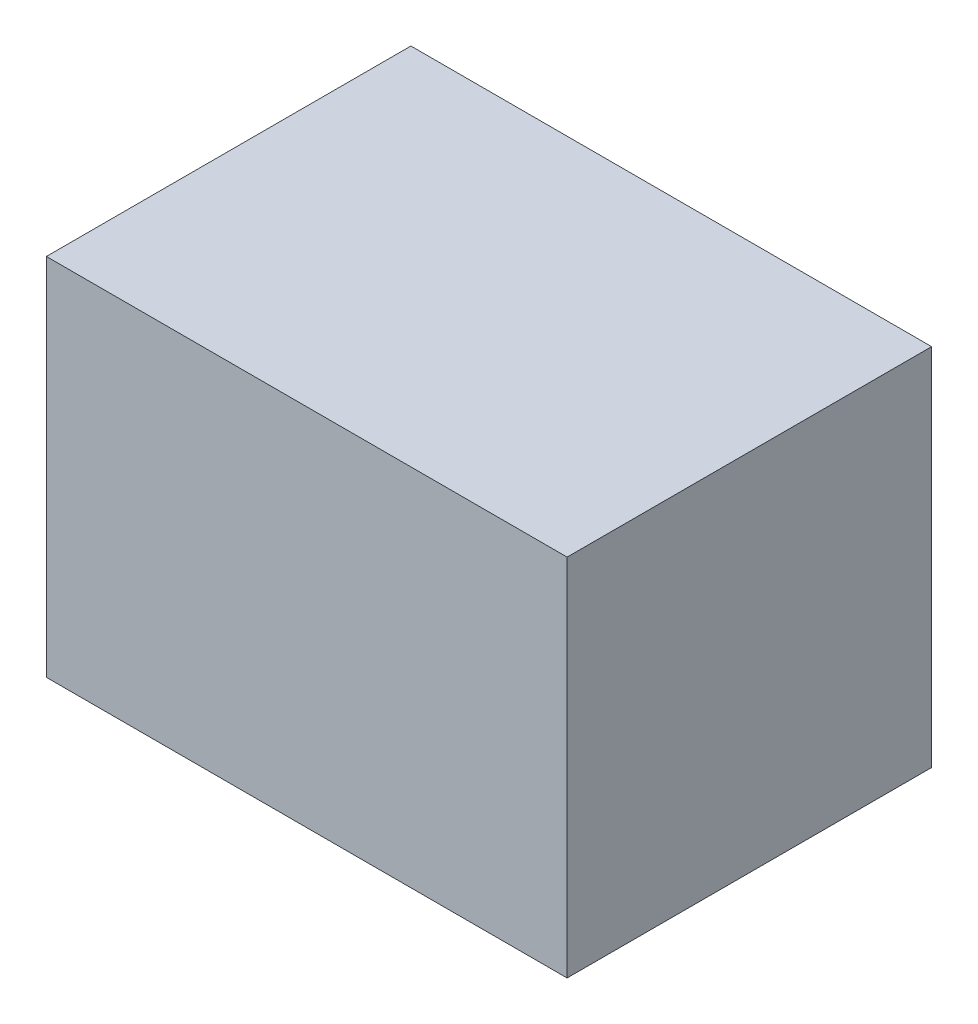
ISO-10303-21;
HEADER;
FILE_DESCRIPTION(('STEP AP214'),'2;1');
FILE_NAME('part.step','',(''),(''),'','','');
FILE_SCHEMA(('AUTOMOTIVE_DESIGN { 1 0 10303 214 1 1 1 1 }'));
ENDSEC;
DATA;
#1=APPLICATION_CONTEXT('core data for automotive mechanical design processes');
#2=APPLICATION_PROTOCOL_DEFINITION('international standard','automotive_design',2000,#1);
#3=PRODUCT_CONTEXT('',#1,'mechanical');
#4=PRODUCT('Part','Part','',(#3));
#5=PRODUCT_RELATED_PRODUCT_CATEGORY('part','',(#4));
#6=PRODUCT_DEFINITION_FORMATION('','',#4);
#7=PRODUCT_DEFINITION_CONTEXT('part definition',#1,'design');
#8=PRODUCT_DEFINITION('design','',#6,#7);
#9=PRODUCT_DEFINITION_SHAPE('','',#8);
#10=(LENGTH_UNIT() NAMED_UNIT(*) SI_UNIT(.MILLI.,.METRE.));
#11=(NAMED_UNIT(*) PLANE_ANGLE_UNIT() SI_UNIT($,.RADIAN.));
#12=(NAMED_UNIT(*) SI_UNIT($,.STERADIAN.) SOLID_ANGLE_UNIT());
#13=UNCERTAINTY_MEASURE_WITH_UNIT(LENGTH_MEASURE(1.E-05),#10,'distance_accuracy_value','');
#14=(GEOMETRIC_REPRESENTATION_CONTEXT(3) GLOBAL_UNCERTAINTY_ASSIGNED_CONTEXT((#13)) GLOBAL_UNIT_ASSIGNED_CONTEXT((#10,
#11,#12)) REPRESENTATION_CONTEXT('',''));
#15=CARTESIAN_POINT('',(0.,0.,0.));
#16=DIRECTION('',(0.,0.,1.));
#17=DIRECTION('',(1.,0.,0.));
#18=AXIS2_PLACEMENT_3D('',#15,#16,#17);
#19=CARTESIAN_POINT('',(-25.4,0.,0.));
#20=DIRECTION('',(0.,-1.,0.));
#21=DIRECTION('',(0.,0.,-1.));
#22=AXIS2_PLACEMENT_3D('',#19,#20,#21);
#23=PLANE('',#22);
#24=DIRECTION('',(1.,0.,0.));
#25=VECTOR('',#24,1.);
#26=CARTESIAN_POINT('',(-25.4,0.,-1.1));
#27=LINE('',#26,#25);
#28=CARTESIAN_POINT('',(-10.41,0.,-1.1));
#29=VERTEX_POINT('',#28);
#30=CARTESIAN_POINT('',(-9.91,0.,-1.1));
#31=VERTEX_POINT('',#30);
#32=EDGE_CURVE('E91',#29,#31,#27,.T.);
#33=ORIENTED_EDGE('',*,*,#32,.F.);
#34=DIRECTION('',(0.,0.,1.));
#35=VECTOR('',#34,1.);
#36=CARTESIAN_POINT('',(-10.41,0.,0.));
#37=LINE('',#36,#35);
#38=CARTESIAN_POINT('',(-10.41,0.,-0.75));
#39=VERTEX_POINT('',#38);
#40=EDGE_CURVE('E28',#29,#39,#37,.T.);
#41=ORIENTED_EDGE('',*,*,#40,.T.);
#42=DIRECTION('',(1.,0.,0.));
#43=VECTOR('',#42,1.);
#44=CARTESIAN_POINT('',(-25.4,0.,-0.75));
#45=LINE('',#44,#43);
#46=CARTESIAN_POINT('',(-9.91,0.,-0.75));
#47=VERTEX_POINT('',#46);
#48=EDGE_CURVE('E79',#39,#47,#45,.T.);
#49=ORIENTED_EDGE('',*,*,#48,.T.);
#50=DIRECTION('',(0.,0.,1.));
#51=VECTOR('',#50,1.);
#52=CARTESIAN_POINT('',(-9.91,0.,0.));
#53=LINE('',#52,#51);
#54=EDGE_CURVE('E103',#31,#47,#53,.T.);
#55=ORIENTED_EDGE('',*,*,#54,.F.);
#56=EDGE_LOOP('',(#33,#41,#49,#55));
#57=FACE_BOUND('',#56,.T.);
#58=ADVANCED_FACE('F17',(#57),#23,.F.);
#59=CARTESIAN_POINT('',(-25.4,-0.35,0.));
#60=DIRECTION('',(0.,-1.,0.));
#61=DIRECTION('',(0.,0.,-1.));
#62=AXIS2_PLACEMENT_3D('',#59,#60,#61);
#63=PLANE('',#62);
#64=DIRECTION('',(1.,0.,0.));
#65=VECTOR('',#64,1.);
#66=CARTESIAN_POINT('',(-25.4,-0.35,-1.1));
#67=LINE('',#66,#65);
#68=CARTESIAN_POINT('',(-10.41,-0.35,-1.1));
#69=VERTEX_POINT('',#68);
#70=CARTESIAN_POINT('',(-9.91,-0.35,-1.1));
#71=VERTEX_POINT('',#70);
#72=EDGE_CURVE('E82',#69,#71,#67,.T.);
#73=ORIENTED_EDGE('',*,*,#72,.T.);
#74=DIRECTION('',(0.,0.,1.));
#75=VECTOR('',#74,1.);
#76=CARTESIAN_POINT('',(-9.91,-0.35,0.));
#77=LINE('',#76,#75);
#78=CARTESIAN_POINT('',(-9.91,-0.35,-0.75));
#79=VERTEX_POINT('',#78);
#80=EDGE_CURVE('E69',#71,#79,#77,.T.);
#81=ORIENTED_EDGE('',*,*,#80,.T.);
#82=DIRECTION('',(1.,0.,0.));
#83=VECTOR('',#82,1.);
#84=CARTESIAN_POINT('',(-25.4,-0.35,-0.75));
#85=LINE('',#84,#83);
#86=CARTESIAN_POINT('',(-10.41,-0.35,-0.75));
#87=VERTEX_POINT('',#86);
#88=EDGE_CURVE('E107',#87,#79,#85,.T.);
#89=ORIENTED_EDGE('',*,*,#88,.F.);
#90=DIRECTION('',(0.,0.,1.));
#91=VECTOR('',#90,1.);
#92=CARTESIAN_POINT('',(-10.41,-0.35,0.));
#93=LINE('',#92,#91);
#94=EDGE_CURVE('E11',#69,#87,#93,.T.);
#95=ORIENTED_EDGE('',*,*,#94,.F.);
#96=EDGE_LOOP('',(#73,#81,#89,#95));
#97=FACE_BOUND('',#96,.T.);
#98=ADVANCED_FACE('F83',(#97),#63,.T.);
#99=CARTESIAN_POINT('',(-10.41,-0.35,0.));
#100=DIRECTION('',(-1.,0.,0.));
#101=DIRECTION('',(0.,0.,1.));
#102=AXIS2_PLACEMENT_3D('',#99,#100,#101);
#103=PLANE('',#102);
#104=ORIENTED_EDGE('',*,*,#40,.F.);
#105=DIRECTION('',(0.,1.,0.));
#106=VECTOR('',#105,1.);
#107=CARTESIAN_POINT('',(-10.41,-0.35,-1.1));
#108=LINE('',#107,#106);
#109=EDGE_CURVE('E87',#69,#29,#108,.T.);
#110=ORIENTED_EDGE('',*,*,#109,.F.);
#111=ORIENTED_EDGE('',*,*,#94,.T.);
#112=DIRECTION('',(0.,1.,0.));
#113=VECTOR('',#112,1.);
#114=CARTESIAN_POINT('',(-10.41,-0.35,-0.75));
#115=LINE('',#114,#113);
#116=EDGE_CURVE('E21',#87,#39,#115,.T.);
#117=ORIENTED_EDGE('',*,*,#116,.T.);
#118=EDGE_LOOP('',(#104,#110,#111,#117));
#119=FACE_BOUND('',#118,.T.);
#120=ADVANCED_FACE('F150',(#119),#103,.T.);
#121=CARTESIAN_POINT('',(-25.4,-0.35,-0.75));
#122=DIRECTION('',(0.,0.,1.));
#123=DIRECTION('',(1.,0.,0.));
#124=AXIS2_PLACEMENT_3D('',#121,#122,#123);
#125=PLANE('',#124);
#126=ORIENTED_EDGE('',*,*,#48,.F.);
#127=ORIENTED_EDGE('',*,*,#116,.F.);
#128=ORIENTED_EDGE('',*,*,#88,.T.);
#129=DIRECTION('',(0.,1.,0.));
#130=VECTOR('',#129,1.);
#131=CARTESIAN_POINT('',(-9.91,-0.35,-0.75));
#132=LINE('',#131,#130);
#133=EDGE_CURVE('E76',#79,#47,#132,.T.);
#134=ORIENTED_EDGE('',*,*,#133,.T.);
#135=EDGE_LOOP('',(#126,#127,#128,#134));
#136=FACE_BOUND('',#135,.T.);
#137=ADVANCED_FACE('F123',(#136),#125,.T.);
#138=CARTESIAN_POINT('',(-9.91,-0.35,0.));
#139=DIRECTION('',(-1.,0.,0.));
#140=DIRECTION('',(0.,0.,1.));
#141=AXIS2_PLACEMENT_3D('',#138,#139,#140);
#142=PLANE('',#141);
#143=ORIENTED_EDGE('',*,*,#54,.T.);
#144=ORIENTED_EDGE('',*,*,#133,.F.);
#145=ORIENTED_EDGE('',*,*,#80,.F.);
#146=DIRECTION('',(0.,1.,0.));
#147=VECTOR('',#146,1.);
#148=CARTESIAN_POINT('',(-9.91,-0.35,-1.1));
#149=LINE('',#148,#147);
#150=EDGE_CURVE('E73',#71,#31,#149,.T.);
#151=ORIENTED_EDGE('',*,*,#150,.T.);
#152=EDGE_LOOP('',(#143,#144,#145,#151));
#153=FACE_BOUND('',#152,.T.);
#154=ADVANCED_FACE('F19',(#153),#142,.F.);
#155=CARTESIAN_POINT('',(-25.4,-0.35,-1.1));
#156=DIRECTION('',(0.,0.,1.));
#157=DIRECTION('',(1.,0.,0.));
#158=AXIS2_PLACEMENT_3D('',#155,#156,#157);
#159=PLANE('',#158);
#160=ORIENTED_EDGE('',*,*,#32,.T.);
#161=ORIENTED_EDGE('',*,*,#150,.F.);
#162=ORIENTED_EDGE('',*,*,#72,.F.);
#163=ORIENTED_EDGE('',*,*,#109,.T.);
#164=EDGE_LOOP('',(#160,#161,#162,#163));
#165=FACE_BOUND('',#164,.T.);
#166=ADVANCED_FACE('F89',(#165),#159,.F.);
#167=CLOSED_SHELL('',(#58,#98,#120,#137,#154,#166));
#168=MANIFOLD_SOLID_BREP('B1',#167);
#169=ADVANCED_BREP_SHAPE_REPRESENTATION('',(#18,#168),#14);
#170=SHAPE_DEFINITION_REPRESENTATION(#9,#169);
ENDSEC;
END-ISO-10303-21;
